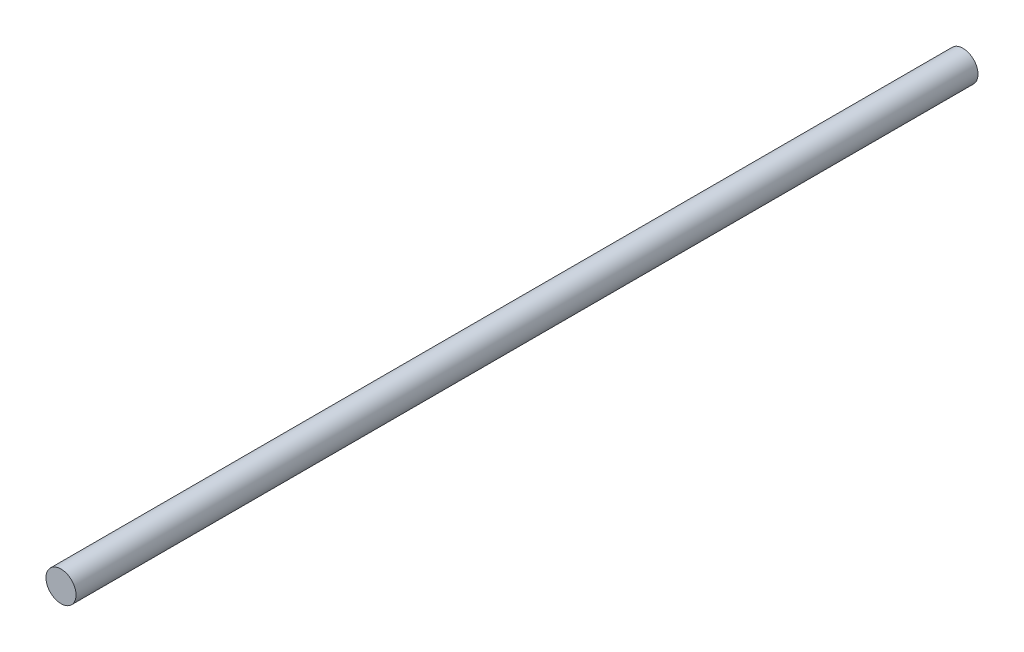
ISO-10303-21;
HEADER;
FILE_DESCRIPTION(('STEP AP214'),'2;1');
FILE_NAME('part.step','',(''),(''),'','','');
FILE_SCHEMA(('AUTOMOTIVE_DESIGN { 1 0 10303 214 1 1 1 1 }'));
ENDSEC;
DATA;
#1=APPLICATION_CONTEXT('core data for automotive mechanical design processes');
#2=APPLICATION_PROTOCOL_DEFINITION('international standard','automotive_design',2000,#1);
#3=PRODUCT_CONTEXT('',#1,'mechanical');
#4=PRODUCT('Part','Part','',(#3));
#5=PRODUCT_RELATED_PRODUCT_CATEGORY('part','',(#4));
#6=PRODUCT_DEFINITION_FORMATION('','',#4);
#7=PRODUCT_DEFINITION_CONTEXT('part definition',#1,'design');
#8=PRODUCT_DEFINITION('design','',#6,#7);
#9=PRODUCT_DEFINITION_SHAPE('','',#8);
#10=(LENGTH_UNIT() NAMED_UNIT(*) SI_UNIT(.MILLI.,.METRE.));
#11=(NAMED_UNIT(*) PLANE_ANGLE_UNIT() SI_UNIT($,.RADIAN.));
#12=(NAMED_UNIT(*) SI_UNIT($,.STERADIAN.) SOLID_ANGLE_UNIT());
#13=UNCERTAINTY_MEASURE_WITH_UNIT(LENGTH_MEASURE(1.E-05),#10,'distance_accuracy_value','');
#14=(GEOMETRIC_REPRESENTATION_CONTEXT(3) GLOBAL_UNCERTAINTY_ASSIGNED_CONTEXT((#13)) GLOBAL_UNIT_ASSIGNED_CONTEXT((#10,
#11,#12)) REPRESENTATION_CONTEXT('',''));
#15=CARTESIAN_POINT('',(0.,0.,0.));
#16=DIRECTION('',(0.,0.,1.));
#17=DIRECTION('',(1.,0.,0.));
#18=AXIS2_PLACEMENT_3D('',#15,#16,#17);
#19=CARTESIAN_POINT('',(0.,0.,381.));
#20=DIRECTION('',(0.,0.,-1.));
#21=DIRECTION('',(-1.,0.,0.));
#22=AXIS2_PLACEMENT_3D('',#19,#20,#21);
#23=CYLINDRICAL_SURFACE('',#22,6.35);
#24=CARTESIAN_POINT('',(0.,0.,381.));
#25=DIRECTION('',(0.,0.,1.));
#26=DIRECTION('',(1.,0.,0.));
#27=AXIS2_PLACEMENT_3D('',#24,#25,#26);
#28=CIRCLE('',#27,6.35);
#29=CARTESIAN_POINT('',(6.35,0.,381.));
#30=VERTEX_POINT('',#29);
#31=EDGE_CURVE('E10',#30,#30,#28,.T.);
#32=ORIENTED_EDGE('',*,*,#31,.F.);
#33=EDGE_LOOP('',(#32));
#34=FACE_BOUND('',#33,.T.);
#35=CARTESIAN_POINT('',(0.,0.,0.));
#36=DIRECTION('',(0.,0.,1.));
#37=DIRECTION('',(1.,0.,0.));
#38=AXIS2_PLACEMENT_3D('',#35,#36,#37);
#39=CIRCLE('',#38,6.35);
#40=CARTESIAN_POINT('',(6.35,0.,0.));
#41=VERTEX_POINT('',#40);
#42=EDGE_CURVE('E34',#41,#41,#39,.T.);
#43=ORIENTED_EDGE('',*,*,#42,.T.);
#44=EDGE_LOOP('',(#43));
#45=FACE_BOUND('',#44,.T.);
#46=ADVANCED_FACE('F31',(#34,#45),#23,.T.);
#47=CARTESIAN_POINT('',(0.,0.,381.));
#48=DIRECTION('',(0.,0.,1.));
#49=DIRECTION('',(1.,0.,0.));
#50=AXIS2_PLACEMENT_3D('',#47,#48,#49);
#51=PLANE('',#50);
#52=ORIENTED_EDGE('',*,*,#31,.T.);
#53=EDGE_LOOP('',(#52));
#54=FACE_BOUND('',#53,.T.);
#55=ADVANCED_FACE('F46',(#54),#51,.T.);
#56=CARTESIAN_POINT('',(0.,0.,0.));
#57=DIRECTION('',(0.,0.,1.));
#58=DIRECTION('',(1.,0.,0.));
#59=AXIS2_PLACEMENT_3D('',#56,#57,#58);
#60=PLANE('',#59);
#61=ORIENTED_EDGE('',*,*,#42,.F.);
#62=EDGE_LOOP('',(#61));
#63=FACE_BOUND('',#62,.T.);
#64=ADVANCED_FACE('F44',(#63),#60,.F.);
#65=CLOSED_SHELL('',(#46,#55,#64));
#66=MANIFOLD_SOLID_BREP('B2',#65);
#67=ADVANCED_BREP_SHAPE_REPRESENTATION('',(#18,#66),#14);
#68=SHAPE_DEFINITION_REPRESENTATION(#9,#67);
ENDSEC;
END-ISO-10303-21;
